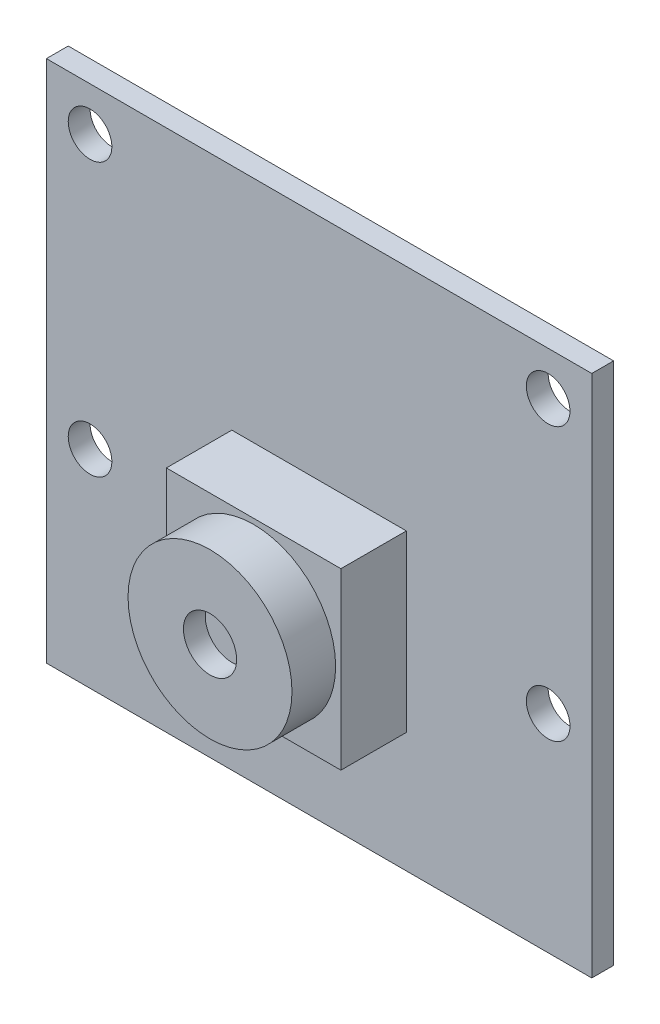
ISO-10303-21;
HEADER;
FILE_DESCRIPTION(('STEP AP214'),'2;1');
FILE_NAME('part.step','',(''),(''),'','','');
FILE_SCHEMA(('AUTOMOTIVE_DESIGN { 1 0 10303 214 1 1 1 1 }'));
ENDSEC;
DATA;
#1=APPLICATION_CONTEXT('core data for automotive mechanical design processes');
#2=APPLICATION_PROTOCOL_DEFINITION('international standard','automotive_design',2000,#1);
#3=PRODUCT_CONTEXT('',#1,'mechanical');
#4=PRODUCT('Part','Part','',(#3));
#5=PRODUCT_RELATED_PRODUCT_CATEGORY('part','',(#4));
#6=PRODUCT_DEFINITION_FORMATION('','',#4);
#7=PRODUCT_DEFINITION_CONTEXT('part definition',#1,'design');
#8=PRODUCT_DEFINITION('design','',#6,#7);
#9=PRODUCT_DEFINITION_SHAPE('','',#8);
#10=(LENGTH_UNIT() NAMED_UNIT(*) SI_UNIT(.MILLI.,.METRE.));
#11=(NAMED_UNIT(*) PLANE_ANGLE_UNIT() SI_UNIT($,.RADIAN.));
#12=(NAMED_UNIT(*) SI_UNIT($,.STERADIAN.) SOLID_ANGLE_UNIT());
#13=UNCERTAINTY_MEASURE_WITH_UNIT(LENGTH_MEASURE(1.E-05),#10,'distance_accuracy_value','');
#14=(GEOMETRIC_REPRESENTATION_CONTEXT(3) GLOBAL_UNCERTAINTY_ASSIGNED_CONTEXT((#13)) GLOBAL_UNIT_ASSIGNED_CONTEXT((#10,
#11,#12)) REPRESENTATION_CONTEXT('',''));
#15=CARTESIAN_POINT('',(0.,0.,0.));
#16=DIRECTION('',(0.,0.,1.));
#17=DIRECTION('',(1.,0.,0.));
#18=AXIS2_PLACEMENT_3D('',#15,#16,#17);
#19=CARTESIAN_POINT('',(0.,-2.50000000000002,6.));
#20=DIRECTION('',(0.,0.,-1.));
#21=DIRECTION('',(-1.,0.,0.));
#22=AXIS2_PLACEMENT_3D('',#19,#20,#21);
#23=CYLINDRICAL_SURFACE('',#22,3.75777799068408);
#24=CARTESIAN_POINT('',(0.,-2.50000000000002,6.));
#25=DIRECTION('',(0.,0.,1.));
#26=DIRECTION('',(1.,0.,0.));
#27=AXIS2_PLACEMENT_3D('',#24,#25,#26);
#28=CIRCLE('',#27,3.75777799068408);
#29=CARTESIAN_POINT('',(3.75777799068408,-2.50000000000002,6.));
#30=VERTEX_POINT('',#29);
#31=EDGE_CURVE('E11',#30,#30,#28,.T.);
#32=ORIENTED_EDGE('',*,*,#31,.F.);
#33=EDGE_LOOP('',(#32));
#34=FACE_BOUND('',#33,.T.);
#35=CARTESIAN_POINT('',(0.,-2.50000000000002,4.));
#36=DIRECTION('',(0.,0.,1.));
#37=DIRECTION('',(1.,0.,0.));
#38=AXIS2_PLACEMENT_3D('',#35,#36,#37);
#39=CIRCLE('',#38,3.75777799068408);
#40=CARTESIAN_POINT('',(3.75777799068408,-2.50000000000002,4.));
#41=VERTEX_POINT('',#40);
#42=EDGE_CURVE('E47',#41,#41,#39,.T.);
#43=ORIENTED_EDGE('',*,*,#42,.T.);
#44=EDGE_LOOP('',(#43));
#45=FACE_BOUND('',#44,.T.);
#46=ADVANCED_FACE('F44',(#34,#45),#23,.T.);
#47=CARTESIAN_POINT('',(0.,-2.50000000000002,6.));
#48=DIRECTION('',(0.,0.,1.));
#49=DIRECTION('',(1.,0.,0.));
#50=AXIS2_PLACEMENT_3D('',#47,#48,#49);
#51=PLANE('',#50);
#52=CARTESIAN_POINT('',(0.,-2.50000000000002,6.));
#53=DIRECTION('',(0.,0.,1.));
#54=DIRECTION('',(1.,0.,0.));
#55=AXIS2_PLACEMENT_3D('',#52,#53,#54);
#56=CIRCLE('',#55,1.21903368647642);
#57=CARTESIAN_POINT('',(1.21903368647642,-2.50000000000002,6.));
#58=VERTEX_POINT('',#57);
#59=EDGE_CURVE('E56',#58,#58,#56,.T.);
#60=ORIENTED_EDGE('',*,*,#59,.F.);
#61=EDGE_LOOP('',(#60));
#62=FACE_BOUND('',#61,.T.);
#63=ORIENTED_EDGE('',*,*,#31,.T.);
#64=EDGE_LOOP('',(#63));
#65=FACE_BOUND('',#64,.T.);
#66=ADVANCED_FACE('F71',(#62,#65),#51,.T.);
#67=CARTESIAN_POINT('',(0.,-2.50000000000002,4.));
#68=DIRECTION('',(0.,0.,1.));
#69=DIRECTION('',(1.,0.,0.));
#70=AXIS2_PLACEMENT_3D('',#67,#68,#69);
#71=PLANE('',#70);
#72=ORIENTED_EDGE('',*,*,#42,.F.);
#73=EDGE_LOOP('',(#72));
#74=FACE_BOUND('',#73,.T.);
#75=ADVANCED_FACE('F67',(#74),#71,.F.);
#76=CARTESIAN_POINT('',(0.,-2.50000000000002,5.));
#77=DIRECTION('',(0.,0.,1.));
#78=DIRECTION('',(1.,0.,0.));
#79=AXIS2_PLACEMENT_3D('',#76,#77,#78);
#80=CYLINDRICAL_SURFACE('',#79,1.21903368647642);
#81=CARTESIAN_POINT('',(0.,-2.50000000000002,5.));
#82=DIRECTION('',(0.,0.,1.));
#83=DIRECTION('',(1.,0.,0.));
#84=AXIS2_PLACEMENT_3D('',#81,#82,#83);
#85=CIRCLE('',#84,1.21903368647642);
#86=CARTESIAN_POINT('',(1.21903368647642,-2.50000000000002,5.));
#87=VERTEX_POINT('',#86);
#88=EDGE_CURVE('E54',#87,#87,#85,.T.);
#89=ORIENTED_EDGE('',*,*,#88,.F.);
#90=EDGE_LOOP('',(#89));
#91=FACE_BOUND('',#90,.T.);
#92=ORIENTED_EDGE('',*,*,#59,.T.);
#93=EDGE_LOOP('',(#92));
#94=FACE_BOUND('',#93,.T.);
#95=ADVANCED_FACE('F64',(#91,#94),#80,.F.);
#96=CARTESIAN_POINT('',(0.,-2.50000000000002,5.));
#97=DIRECTION('',(0.,0.,1.));
#98=DIRECTION('',(1.,0.,0.));
#99=AXIS2_PLACEMENT_3D('',#96,#97,#98);
#100=PLANE('',#99);
#101=ORIENTED_EDGE('',*,*,#88,.T.);
#102=EDGE_LOOP('',(#101));
#103=FACE_BOUND('',#102,.T.);
#104=ADVANCED_FACE('F62',(#103),#100,.T.);
#105=CLOSED_SHELL('',(#46,#66,#75,#95,#104));
#106=MANIFOLD_SOLID_BREP('B2',#105);
#107=CARTESIAN_POINT('',(4.,-6.5,4.));
#108=DIRECTION('',(-1.,0.,0.));
#109=DIRECTION('',(0.,-1.,0.));
#110=AXIS2_PLACEMENT_3D('',#107,#108,#109);
#111=PLANE('',#110);
#112=DIRECTION('',(0.,1.,0.));
#113=VECTOR('',#112,1.);
#114=CARTESIAN_POINT('',(4.,-6.5,1.));
#115=LINE('',#114,#113);
#116=CARTESIAN_POINT('',(4.,-6.5,1.));
#117=VERTEX_POINT('',#116);
#118=CARTESIAN_POINT('',(4.,1.5,1.));
#119=VERTEX_POINT('',#118);
#120=EDGE_CURVE('E187',#117,#119,#115,.T.);
#121=ORIENTED_EDGE('',*,*,#120,.T.);
#122=DIRECTION('',(0.,0.,-1.));
#123=VECTOR('',#122,1.);
#124=CARTESIAN_POINT('',(4.,1.5,4.));
#125=LINE('',#124,#123);
#126=CARTESIAN_POINT('',(4.,1.5,4.));
#127=VERTEX_POINT('',#126);
#128=EDGE_CURVE('E42',#127,#119,#125,.T.);
#129=ORIENTED_EDGE('',*,*,#128,.F.);
#130=DIRECTION('',(0.,1.,0.));
#131=VECTOR('',#130,1.);
#132=CARTESIAN_POINT('',(4.,-6.5,4.));
#133=LINE('',#132,#131);
#134=CARTESIAN_POINT('',(4.,-6.5,4.));
#135=VERTEX_POINT('',#134);
#136=EDGE_CURVE('E175',#135,#127,#133,.T.);
#137=ORIENTED_EDGE('',*,*,#136,.F.);
#138=DIRECTION('',(0.,0.,-1.));
#139=VECTOR('',#138,1.);
#140=CARTESIAN_POINT('',(4.,-6.5,4.));
#141=LINE('',#140,#139);
#142=EDGE_CURVE('E183',#135,#117,#141,.T.);
#143=ORIENTED_EDGE('',*,*,#142,.T.);
#144=EDGE_LOOP('',(#121,#129,#137,#143));
#145=FACE_BOUND('',#144,.T.);
#146=ADVANCED_FACE('F124',(#145),#111,.F.);
#147=CARTESIAN_POINT('',(-4.,1.5,4.));
#148=DIRECTION('',(0.,-1.,0.));
#149=DIRECTION('',(0.,0.,-1.));
#150=AXIS2_PLACEMENT_3D('',#147,#148,#149);
#151=PLANE('',#150);
#152=DIRECTION('',(-1.,0.,0.));
#153=VECTOR('',#152,1.);
#154=CARTESIAN_POINT('',(-4.,1.5,1.));
#155=LINE('',#154,#153);
#156=CARTESIAN_POINT('',(-4.,1.5,1.));
#157=VERTEX_POINT('',#156);
#158=EDGE_CURVE('E179',#119,#157,#155,.T.);
#159=ORIENTED_EDGE('',*,*,#158,.T.);
#160=DIRECTION('',(0.,0.,-1.));
#161=VECTOR('',#160,1.);
#162=CARTESIAN_POINT('',(-4.,1.5,4.));
#163=LINE('',#162,#161);
#164=CARTESIAN_POINT('',(-4.,1.5,4.));
#165=VERTEX_POINT('',#164);
#166=EDGE_CURVE('E132',#165,#157,#163,.T.);
#167=ORIENTED_EDGE('',*,*,#166,.F.);
#168=DIRECTION('',(-1.,0.,0.));
#169=VECTOR('',#168,1.);
#170=CARTESIAN_POINT('',(-4.,1.5,4.));
#171=LINE('',#170,#169);
#172=EDGE_CURVE('E170',#127,#165,#171,.T.);
#173=ORIENTED_EDGE('',*,*,#172,.F.);
#174=ORIENTED_EDGE('',*,*,#128,.T.);
#175=EDGE_LOOP('',(#159,#167,#173,#174));
#176=FACE_BOUND('',#175,.T.);
#177=ADVANCED_FACE('F178',(#176),#151,.F.);
#178=CARTESIAN_POINT('',(-4.,-6.5,4.));
#179=DIRECTION('',(1.,0.,0.));
#180=DIRECTION('',(0.,1.,0.));
#181=AXIS2_PLACEMENT_3D('',#178,#179,#180);
#182=PLANE('',#181);
#183=DIRECTION('',(0.,-1.,0.));
#184=VECTOR('',#183,1.);
#185=CARTESIAN_POINT('',(-4.,-6.5,1.));
#186=LINE('',#185,#184);
#187=CARTESIAN_POINT('',(-4.,-6.5,1.));
#188=VERTEX_POINT('',#187);
#189=EDGE_CURVE('E157',#157,#188,#186,.T.);
#190=ORIENTED_EDGE('',*,*,#189,.T.);
#191=DIRECTION('',(0.,0.,-1.));
#192=VECTOR('',#191,1.);
#193=CARTESIAN_POINT('',(-4.,-6.5,4.));
#194=LINE('',#193,#192);
#195=CARTESIAN_POINT('',(-4.,-6.5,4.));
#196=VERTEX_POINT('',#195);
#197=EDGE_CURVE('E180',#196,#188,#194,.T.);
#198=ORIENTED_EDGE('',*,*,#197,.F.);
#199=DIRECTION('',(0.,-1.,0.));
#200=VECTOR('',#199,1.);
#201=CARTESIAN_POINT('',(-4.,-6.5,4.));
#202=LINE('',#201,#200);
#203=EDGE_CURVE('E173',#165,#196,#202,.T.);
#204=ORIENTED_EDGE('',*,*,#203,.F.);
#205=ORIENTED_EDGE('',*,*,#166,.T.);
#206=EDGE_LOOP('',(#190,#198,#204,#205));
#207=FACE_BOUND('',#206,.T.);
#208=ADVANCED_FACE('F181',(#207),#182,.F.);
#209=CARTESIAN_POINT('',(-4.,-6.5,4.));
#210=DIRECTION('',(0.,1.,0.));
#211=DIRECTION('',(0.,0.,1.));
#212=AXIS2_PLACEMENT_3D('',#209,#210,#211);
#213=PLANE('',#212);
#214=DIRECTION('',(1.,0.,0.));
#215=VECTOR('',#214,1.);
#216=CARTESIAN_POINT('',(-4.,-6.5,1.));
#217=LINE('',#216,#215);
#218=EDGE_CURVE('E163',#188,#117,#217,.T.);
#219=ORIENTED_EDGE('',*,*,#218,.T.);
#220=ORIENTED_EDGE('',*,*,#142,.F.);
#221=DIRECTION('',(1.,0.,0.));
#222=VECTOR('',#221,1.);
#223=CARTESIAN_POINT('',(-4.,-6.5,4.));
#224=LINE('',#223,#222);
#225=EDGE_CURVE('E140',#196,#135,#224,.T.);
#226=ORIENTED_EDGE('',*,*,#225,.F.);
#227=ORIENTED_EDGE('',*,*,#197,.T.);
#228=EDGE_LOOP('',(#219,#220,#226,#227));
#229=FACE_BOUND('',#228,.T.);
#230=ADVANCED_FACE('F194',(#229),#213,.F.);
#231=CARTESIAN_POINT('',(0.,0.,4.));
#232=DIRECTION('',(0.,0.,-1.));
#233=DIRECTION('',(-1.,0.,0.));
#234=AXIS2_PLACEMENT_3D('',#231,#232,#233);
#235=PLANE('',#234);
#236=ORIENTED_EDGE('',*,*,#136,.T.);
#237=ORIENTED_EDGE('',*,*,#172,.T.);
#238=ORIENTED_EDGE('',*,*,#203,.T.);
#239=ORIENTED_EDGE('',*,*,#225,.T.);
#240=EDGE_LOOP('',(#236,#237,#238,#239));
#241=FACE_BOUND('',#240,.T.);
#242=ADVANCED_FACE('F171',(#241),#235,.F.);
#243=CARTESIAN_POINT('',(0.,0.,1.));
#244=DIRECTION('',(0.,0.,-1.));
#245=DIRECTION('',(-1.,0.,0.));
#246=AXIS2_PLACEMENT_3D('',#243,#244,#245);
#247=PLANE('',#246);
#248=ORIENTED_EDGE('',*,*,#120,.F.);
#249=ORIENTED_EDGE('',*,*,#218,.F.);
#250=ORIENTED_EDGE('',*,*,#189,.F.);
#251=ORIENTED_EDGE('',*,*,#158,.F.);
#252=EDGE_LOOP('',(#248,#249,#250,#251));
#253=FACE_BOUND('',#252,.T.);
#254=ADVANCED_FACE('F197',(#253),#247,.T.);
#255=CLOSED_SHELL('',(#146,#177,#208,#230,#242,#254));
#256=MANIFOLD_SOLID_BREP('B6',#255);
#257=CARTESIAN_POINT('',(12.5,-12.,1.));
#258=DIRECTION('',(-1.,0.,0.));
#259=DIRECTION('',(0.,0.,1.));
#260=AXIS2_PLACEMENT_3D('',#257,#258,#259);
#261=PLANE('',#260);
#262=DIRECTION('',(0.,1.,0.));
#263=VECTOR('',#262,1.);
#264=CARTESIAN_POINT('',(12.5,-12.,0.));
#265=LINE('',#264,#263);
#266=CARTESIAN_POINT('',(12.5,-12.,0.));
#267=VERTEX_POINT('',#266);
#268=CARTESIAN_POINT('',(12.5,12.,0.));
#269=VERTEX_POINT('',#268);
#270=EDGE_CURVE('E311',#267,#269,#265,.T.);
#271=ORIENTED_EDGE('',*,*,#270,.T.);
#272=DIRECTION('',(0.,0.,-1.));
#273=VECTOR('',#272,1.);
#274=CARTESIAN_POINT('',(12.5,12.,1.));
#275=LINE('',#274,#273);
#276=CARTESIAN_POINT('',(12.5,12.,1.));
#277=VERTEX_POINT('',#276);
#278=EDGE_CURVE('E122',#277,#269,#275,.T.);
#279=ORIENTED_EDGE('',*,*,#278,.F.);
#280=DIRECTION('',(0.,1.,0.));
#281=VECTOR('',#280,1.);
#282=CARTESIAN_POINT('',(12.5,-12.,1.));
#283=LINE('',#282,#281);
#284=CARTESIAN_POINT('',(12.5,-12.,1.));
#285=VERTEX_POINT('',#284);
#286=EDGE_CURVE('E299',#285,#277,#283,.T.);
#287=ORIENTED_EDGE('',*,*,#286,.F.);
#288=DIRECTION('',(0.,0.,-1.));
#289=VECTOR('',#288,1.);
#290=CARTESIAN_POINT('',(12.5,-12.,1.));
#291=LINE('',#290,#289);
#292=EDGE_CURVE('E307',#285,#267,#291,.T.);
#293=ORIENTED_EDGE('',*,*,#292,.T.);
#294=EDGE_LOOP('',(#271,#279,#287,#293));
#295=FACE_BOUND('',#294,.T.);
#296=ADVANCED_FACE('F248',(#295),#261,.F.);
#297=CARTESIAN_POINT('',(-12.5,12.,1.));
#298=DIRECTION('',(0.,-1.,0.));
#299=DIRECTION('',(0.,0.,-1.));
#300=AXIS2_PLACEMENT_3D('',#297,#298,#299);
#301=PLANE('',#300);
#302=DIRECTION('',(-1.,0.,0.));
#303=VECTOR('',#302,1.);
#304=CARTESIAN_POINT('',(-12.5,12.,0.));
#305=LINE('',#304,#303);
#306=CARTESIAN_POINT('',(-12.5,12.,0.));
#307=VERTEX_POINT('',#306);
#308=EDGE_CURVE('E303',#269,#307,#305,.T.);
#309=ORIENTED_EDGE('',*,*,#308,.T.);
#310=DIRECTION('',(0.,0.,-1.));
#311=VECTOR('',#310,1.);
#312=CARTESIAN_POINT('',(-12.5,12.,1.));
#313=LINE('',#312,#311);
#314=CARTESIAN_POINT('',(-12.5,12.,1.));
#315=VERTEX_POINT('',#314);
#316=EDGE_CURVE('E256',#315,#307,#313,.T.);
#317=ORIENTED_EDGE('',*,*,#316,.F.);
#318=DIRECTION('',(-1.,0.,0.));
#319=VECTOR('',#318,1.);
#320=CARTESIAN_POINT('',(-12.5,12.,1.));
#321=LINE('',#320,#319);
#322=EDGE_CURVE('E294',#277,#315,#321,.T.);
#323=ORIENTED_EDGE('',*,*,#322,.F.);
#324=ORIENTED_EDGE('',*,*,#278,.T.);
#325=EDGE_LOOP('',(#309,#317,#323,#324));
#326=FACE_BOUND('',#325,.T.);
#327=ADVANCED_FACE('F302',(#326),#301,.F.);
#328=CARTESIAN_POINT('',(-12.5,-12.,1.));
#329=DIRECTION('',(1.,0.,0.));
#330=DIRECTION('',(0.,0.,-1.));
#331=AXIS2_PLACEMENT_3D('',#328,#329,#330);
#332=PLANE('',#331);
#333=DIRECTION('',(0.,-1.,0.));
#334=VECTOR('',#333,1.);
#335=CARTESIAN_POINT('',(-12.5,-12.,0.));
#336=LINE('',#335,#334);
#337=CARTESIAN_POINT('',(-12.5,-12.,0.));
#338=VERTEX_POINT('',#337);
#339=EDGE_CURVE('E281',#307,#338,#336,.T.);
#340=ORIENTED_EDGE('',*,*,#339,.T.);
#341=DIRECTION('',(0.,0.,-1.));
#342=VECTOR('',#341,1.);
#343=CARTESIAN_POINT('',(-12.5,-12.,1.));
#344=LINE('',#343,#342);
#345=CARTESIAN_POINT('',(-12.5,-12.,1.));
#346=VERTEX_POINT('',#345);
#347=EDGE_CURVE('E304',#346,#338,#344,.T.);
#348=ORIENTED_EDGE('',*,*,#347,.F.);
#349=DIRECTION('',(0.,-1.,0.));
#350=VECTOR('',#349,1.);
#351=CARTESIAN_POINT('',(-12.5,-12.,1.));
#352=LINE('',#351,#350);
#353=EDGE_CURVE('E297',#315,#346,#352,.T.);
#354=ORIENTED_EDGE('',*,*,#353,.F.);
#355=ORIENTED_EDGE('',*,*,#316,.T.);
#356=EDGE_LOOP('',(#340,#348,#354,#355));
#357=FACE_BOUND('',#356,.T.);
#358=ADVANCED_FACE('F305',(#357),#332,.F.);
#359=CARTESIAN_POINT('',(-12.5,-12.,1.));
#360=DIRECTION('',(0.,1.,0.));
#361=DIRECTION('',(0.,0.,1.));
#362=AXIS2_PLACEMENT_3D('',#359,#360,#361);
#363=PLANE('',#362);
#364=DIRECTION('',(1.,0.,0.));
#365=VECTOR('',#364,1.);
#366=CARTESIAN_POINT('',(-12.5,-12.,0.));
#367=LINE('',#366,#365);
#368=EDGE_CURVE('E287',#338,#267,#367,.T.);
#369=ORIENTED_EDGE('',*,*,#368,.T.);
#370=ORIENTED_EDGE('',*,*,#292,.F.);
#371=DIRECTION('',(1.,0.,0.));
#372=VECTOR('',#371,1.);
#373=CARTESIAN_POINT('',(-12.5,-12.,1.));
#374=LINE('',#373,#372);
#375=EDGE_CURVE('E264',#346,#285,#374,.T.);
#376=ORIENTED_EDGE('',*,*,#375,.F.);
#377=ORIENTED_EDGE('',*,*,#347,.T.);
#378=EDGE_LOOP('',(#369,#370,#376,#377));
#379=FACE_BOUND('',#378,.T.);
#380=ADVANCED_FACE('F319',(#379),#363,.F.);
#381=CARTESIAN_POINT('',(0.,0.,1.));
#382=DIRECTION('',(0.,0.,-1.));
#383=DIRECTION('',(-1.,0.,0.));
#384=AXIS2_PLACEMENT_3D('',#381,#382,#383);
#385=PLANE('',#384);
#386=CARTESIAN_POINT('',(10.5,-2.49999999999999,1.));
#387=DIRECTION('',(0.,0.,-1.));
#388=DIRECTION('',(-1.,0.,0.));
#389=AXIS2_PLACEMENT_3D('',#386,#387,#388);
#390=CIRCLE('',#389,1.);
#391=CARTESIAN_POINT('',(9.50000000000001,-2.49999999999999,1.));
#392=VERTEX_POINT('',#391);
#393=EDGE_CURVE('E314',#392,#392,#390,.T.);
#394=ORIENTED_EDGE('',*,*,#393,.T.);
#395=EDGE_LOOP('',(#394));
#396=FACE_BOUND('',#395,.T.);
#397=CARTESIAN_POINT('',(10.5,10.,1.));
#398=DIRECTION('',(0.,0.,-1.));
#399=DIRECTION('',(-1.,0.,0.));
#400=AXIS2_PLACEMENT_3D('',#397,#398,#399);
#401=CIRCLE('',#400,1.);
#402=CARTESIAN_POINT('',(9.5,10.,1.));
#403=VERTEX_POINT('',#402);
#404=EDGE_CURVE('E327',#403,#403,#401,.T.);
#405=ORIENTED_EDGE('',*,*,#404,.T.);
#406=EDGE_LOOP('',(#405));
#407=FACE_BOUND('',#406,.T.);
#408=CARTESIAN_POINT('',(-10.5,10.,1.));
#409=DIRECTION('',(0.,0.,-1.));
#410=DIRECTION('',(-1.,0.,0.));
#411=AXIS2_PLACEMENT_3D('',#408,#409,#410);
#412=CIRCLE('',#411,1.);
#413=CARTESIAN_POINT('',(-11.5,10.,1.));
#414=VERTEX_POINT('',#413);
#415=EDGE_CURVE('E330',#414,#414,#412,.T.);
#416=ORIENTED_EDGE('',*,*,#415,.T.);
#417=EDGE_LOOP('',(#416));
#418=FACE_BOUND('',#417,.T.);
#419=CARTESIAN_POINT('',(-10.5,-2.5,1.));
#420=DIRECTION('',(0.,0.,-1.));
#421=DIRECTION('',(-1.,0.,0.));
#422=AXIS2_PLACEMENT_3D('',#419,#420,#421);
#423=CIRCLE('',#422,1.);
#424=CARTESIAN_POINT('',(-11.5,-2.5,1.));
#425=VERTEX_POINT('',#424);
#426=EDGE_CURVE('E333',#425,#425,#423,.T.);
#427=ORIENTED_EDGE('',*,*,#426,.T.);
#428=EDGE_LOOP('',(#427));
#429=FACE_BOUND('',#428,.T.);
#430=ORIENTED_EDGE('',*,*,#286,.T.);
#431=ORIENTED_EDGE('',*,*,#322,.T.);
#432=ORIENTED_EDGE('',*,*,#353,.T.);
#433=ORIENTED_EDGE('',*,*,#375,.T.);
#434=EDGE_LOOP('',(#430,#431,#432,#433));
#435=FACE_BOUND('',#434,.T.);
#436=ADVANCED_FACE('F295',(#396,#407,#418,#429,#435),#385,.F.);
#437=CARTESIAN_POINT('',(0.,0.,0.));
#438=DIRECTION('',(0.,0.,-1.));
#439=DIRECTION('',(-1.,0.,0.));
#440=AXIS2_PLACEMENT_3D('',#437,#438,#439);
#441=PLANE('',#440);
#442=CARTESIAN_POINT('',(10.5,-2.49999999999999,0.));
#443=DIRECTION('',(0.,0.,1.));
#444=DIRECTION('',(1.,0.,0.));
#445=AXIS2_PLACEMENT_3D('',#442,#443,#444);
#446=CIRCLE('',#445,1.);
#447=CARTESIAN_POINT('',(11.5,-2.49999999999999,0.));
#448=VERTEX_POINT('',#447);
#449=EDGE_CURVE('E340',#448,#448,#446,.T.);
#450=ORIENTED_EDGE('',*,*,#449,.T.);
#451=EDGE_LOOP('',(#450));
#452=FACE_BOUND('',#451,.T.);
#453=CARTESIAN_POINT('',(10.5,10.,0.));
#454=DIRECTION('',(0.,0.,1.));
#455=DIRECTION('',(1.,0.,0.));
#456=AXIS2_PLACEMENT_3D('',#453,#454,#455);
#457=CIRCLE('',#456,1.);
#458=CARTESIAN_POINT('',(11.5,10.,0.));
#459=VERTEX_POINT('',#458);
#460=EDGE_CURVE('E343',#459,#459,#457,.T.);
#461=ORIENTED_EDGE('',*,*,#460,.T.);
#462=EDGE_LOOP('',(#461));
#463=FACE_BOUND('',#462,.T.);
#464=CARTESIAN_POINT('',(-10.5,10.,0.));
#465=DIRECTION('',(0.,0.,1.));
#466=DIRECTION('',(1.,0.,0.));
#467=AXIS2_PLACEMENT_3D('',#464,#465,#466);
#468=CIRCLE('',#467,1.);
#469=CARTESIAN_POINT('',(-9.5,10.,0.));
#470=VERTEX_POINT('',#469);
#471=EDGE_CURVE('E339',#470,#470,#468,.T.);
#472=ORIENTED_EDGE('',*,*,#471,.T.);
#473=EDGE_LOOP('',(#472));
#474=FACE_BOUND('',#473,.T.);
#475=CARTESIAN_POINT('',(-10.5,-2.5,0.));
#476=DIRECTION('',(0.,0.,1.));
#477=DIRECTION('',(1.,0.,0.));
#478=AXIS2_PLACEMENT_3D('',#475,#476,#477);
#479=CIRCLE('',#478,1.);
#480=CARTESIAN_POINT('',(-9.5,-2.5,0.));
#481=VERTEX_POINT('',#480);
#482=EDGE_CURVE('E336',#481,#481,#479,.T.);
#483=ORIENTED_EDGE('',*,*,#482,.T.);
#484=EDGE_LOOP('',(#483));
#485=FACE_BOUND('',#484,.T.);
#486=ORIENTED_EDGE('',*,*,#270,.F.);
#487=ORIENTED_EDGE('',*,*,#368,.F.);
#488=ORIENTED_EDGE('',*,*,#339,.F.);
#489=ORIENTED_EDGE('',*,*,#308,.F.);
#490=EDGE_LOOP('',(#486,#487,#488,#489));
#491=FACE_BOUND('',#490,.T.);
#492=ADVANCED_FACE('F322',(#452,#463,#474,#485,#491),#441,.T.);
#493=CARTESIAN_POINT('',(-10.5,-2.5,0.));
#494=DIRECTION('',(0.,0.,1.));
#495=DIRECTION('',(1.,0.,0.));
#496=AXIS2_PLACEMENT_3D('',#493,#494,#495);
#497=CYLINDRICAL_SURFACE('',#496,1.);
#498=ORIENTED_EDGE('',*,*,#482,.F.);
#499=EDGE_LOOP('',(#498));
#500=FACE_BOUND('',#499,.T.);
#501=ORIENTED_EDGE('',*,*,#426,.F.);
#502=EDGE_LOOP('',(#501));
#503=FACE_BOUND('',#502,.T.);
#504=ADVANCED_FACE('F355',(#500,#503),#497,.F.);
#505=CARTESIAN_POINT('',(-10.5,10.,0.));
#506=DIRECTION('',(0.,0.,1.));
#507=DIRECTION('',(1.,0.,0.));
#508=AXIS2_PLACEMENT_3D('',#505,#506,#507);
#509=CYLINDRICAL_SURFACE('',#508,1.);
#510=ORIENTED_EDGE('',*,*,#471,.F.);
#511=EDGE_LOOP('',(#510));
#512=FACE_BOUND('',#511,.T.);
#513=ORIENTED_EDGE('',*,*,#415,.F.);
#514=EDGE_LOOP('',(#513));
#515=FACE_BOUND('',#514,.T.);
#516=ADVANCED_FACE('F351',(#512,#515),#509,.F.);
#517=CARTESIAN_POINT('',(10.5,10.,0.));
#518=DIRECTION('',(0.,0.,1.));
#519=DIRECTION('',(1.,0.,0.));
#520=AXIS2_PLACEMENT_3D('',#517,#518,#519);
#521=CYLINDRICAL_SURFACE('',#520,1.);
#522=ORIENTED_EDGE('',*,*,#460,.F.);
#523=EDGE_LOOP('',(#522));
#524=FACE_BOUND('',#523,.T.);
#525=ORIENTED_EDGE('',*,*,#404,.F.);
#526=EDGE_LOOP('',(#525));
#527=FACE_BOUND('',#526,.T.);
#528=ADVANCED_FACE('F354',(#524,#527),#521,.F.);
#529=CARTESIAN_POINT('',(10.5,-2.49999999999999,0.));
#530=DIRECTION('',(0.,0.,1.));
#531=DIRECTION('',(1.,0.,0.));
#532=AXIS2_PLACEMENT_3D('',#529,#530,#531);
#533=CYLINDRICAL_SURFACE('',#532,1.);
#534=ORIENTED_EDGE('',*,*,#449,.F.);
#535=EDGE_LOOP('',(#534));
#536=FACE_BOUND('',#535,.T.);
#537=ORIENTED_EDGE('',*,*,#393,.F.);
#538=EDGE_LOOP('',(#537));
#539=FACE_BOUND('',#538,.T.);
#540=ADVANCED_FACE('F416',(#536,#539),#533,.F.);
#541=CLOSED_SHELL('',(#296,#327,#358,#380,#436,#492,#504,#516,#528,#540));
#542=MANIFOLD_SOLID_BREP('B36',#541);
#543=ADVANCED_BREP_SHAPE_REPRESENTATION('',(#18,#106,#256,#542),#14);
#544=SHAPE_DEFINITION_REPRESENTATION(#9,#543);
ENDSEC;
END-ISO-10303-21;
